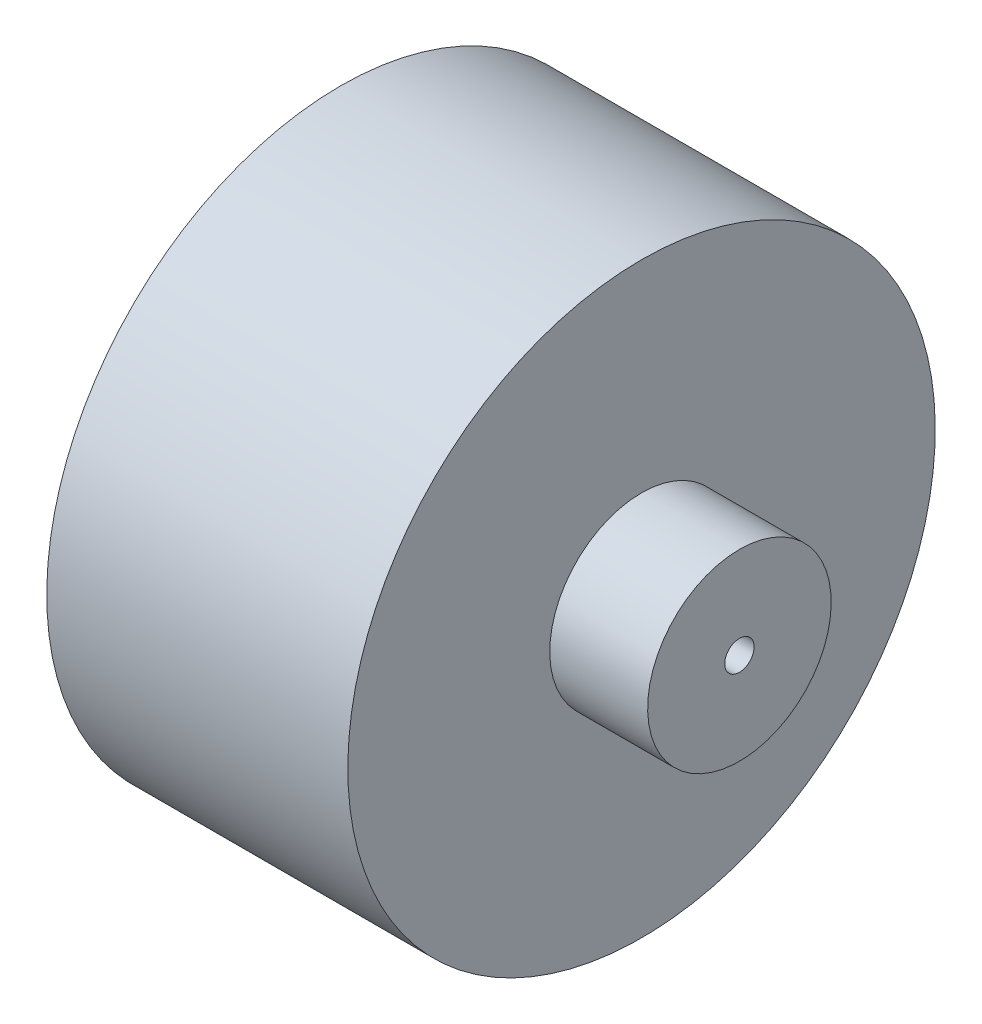
ISO-10303-21;
HEADER;
FILE_DESCRIPTION(('STEP AP214'),'2;1');
FILE_NAME('part.step','',(''),(''),'','','');
FILE_SCHEMA(('AUTOMOTIVE_DESIGN { 1 0 10303 214 1 1 1 1 }'));
ENDSEC;
DATA;
#1=APPLICATION_CONTEXT('core data for automotive mechanical design processes');
#2=APPLICATION_PROTOCOL_DEFINITION('international standard','automotive_design',2000,#1);
#3=PRODUCT_CONTEXT('',#1,'mechanical');
#4=PRODUCT('Part','Part','',(#3));
#5=PRODUCT_RELATED_PRODUCT_CATEGORY('part','',(#4));
#6=PRODUCT_DEFINITION_FORMATION('','',#4);
#7=PRODUCT_DEFINITION_CONTEXT('part definition',#1,'design');
#8=PRODUCT_DEFINITION('design','',#6,#7);
#9=PRODUCT_DEFINITION_SHAPE('','',#8);
#10=(LENGTH_UNIT() NAMED_UNIT(*) SI_UNIT(.MILLI.,.METRE.));
#11=(NAMED_UNIT(*) PLANE_ANGLE_UNIT() SI_UNIT($,.RADIAN.));
#12=(NAMED_UNIT(*) SI_UNIT($,.STERADIAN.) SOLID_ANGLE_UNIT());
#13=UNCERTAINTY_MEASURE_WITH_UNIT(LENGTH_MEASURE(1.E-05),#10,'distance_accuracy_value','');
#14=(GEOMETRIC_REPRESENTATION_CONTEXT(3) GLOBAL_UNCERTAINTY_ASSIGNED_CONTEXT((#13)) GLOBAL_UNIT_ASSIGNED_CONTEXT((#10,
#11,#12)) REPRESENTATION_CONTEXT('',''));
#15=CARTESIAN_POINT('',(0.,0.,0.));
#16=DIRECTION('',(0.,0.,1.));
#17=DIRECTION('',(1.,0.,0.));
#18=AXIS2_PLACEMENT_3D('',#15,#16,#17);
#19=CARTESIAN_POINT('',(-25.,0.,0.));
#20=DIRECTION('',(1.,0.,0.));
#21=DIRECTION('',(0.,1.,0.));
#22=AXIS2_PLACEMENT_3D('',#19,#20,#21);
#23=PLANE('',#22);
#24=CARTESIAN_POINT('',(-25.,0.,0.));
#25=DIRECTION('',(1.,0.,0.));
#26=DIRECTION('',(0.,1.,0.));
#27=AXIS2_PLACEMENT_3D('',#24,#25,#26);
#28=CIRCLE('',#27,6.);
#29=CARTESIAN_POINT('',(-25.,6.,0.));
#30=VERTEX_POINT('',#29);
#31=EDGE_CURVE('E61',#30,#30,#28,.T.);
#32=ORIENTED_EDGE('',*,*,#31,.T.);
#33=EDGE_LOOP('',(#32));
#34=FACE_BOUND('',#33,.T.);
#35=ADVANCED_FACE('F39',(#34),#23,.T.);
#36=CARTESIAN_POINT('',(-163.,0.,0.));
#37=DIRECTION('',(-1.,0.,0.));
#38=DIRECTION('',(0.,-1.,0.));
#39=AXIS2_PLACEMENT_3D('',#36,#37,#38);
#40=PLANE('',#39);
#41=CARTESIAN_POINT('',(-163.,0.,0.));
#42=DIRECTION('',(1.,0.,0.));
#43=DIRECTION('',(0.,1.,0.));
#44=AXIS2_PLACEMENT_3D('',#41,#42,#43);
#45=CIRCLE('',#44,120.);
#46=CARTESIAN_POINT('',(-163.,120.,0.));
#47=VERTEX_POINT('',#46);
#48=EDGE_CURVE('E10',#47,#47,#45,.T.);
#49=ORIENTED_EDGE('',*,*,#48,.F.);
#50=EDGE_LOOP('',(#49));
#51=FACE_BOUND('',#50,.T.);
#52=ADVANCED_FACE('F78',(#51),#40,.T.);
#53=CARTESIAN_POINT('',(0.,0.,0.));
#54=DIRECTION('',(1.,0.,0.));
#55=DIRECTION('',(0.,1.,0.));
#56=AXIS2_PLACEMENT_3D('',#53,#54,#55);
#57=CYLINDRICAL_SURFACE('',#56,120.);
#58=ORIENTED_EDGE('',*,*,#48,.T.);
#59=EDGE_LOOP('',(#58));
#60=FACE_BOUND('',#59,.T.);
#61=CARTESIAN_POINT('',(-40.,0.,0.));
#62=DIRECTION('',(1.,0.,0.));
#63=DIRECTION('',(0.,1.,0.));
#64=AXIS2_PLACEMENT_3D('',#61,#62,#63);
#65=CIRCLE('',#64,120.);
#66=CARTESIAN_POINT('',(-40.,120.,0.));
#67=VERTEX_POINT('',#66);
#68=EDGE_CURVE('E45',#67,#67,#65,.T.);
#69=ORIENTED_EDGE('',*,*,#68,.F.);
#70=EDGE_LOOP('',(#69));
#71=FACE_BOUND('',#70,.T.);
#72=ADVANCED_FACE('F82',(#60,#71),#57,.T.);
#73=CARTESIAN_POINT('',(-40.,120.,0.));
#74=DIRECTION('',(1.,0.,0.));
#75=DIRECTION('',(0.,1.,0.));
#76=AXIS2_PLACEMENT_3D('',#73,#74,#75);
#77=PLANE('',#76);
#78=ORIENTED_EDGE('',*,*,#68,.T.);
#79=EDGE_LOOP('',(#78));
#80=FACE_BOUND('',#79,.T.);
#81=CARTESIAN_POINT('',(-40.,0.,0.));
#82=DIRECTION('',(1.,0.,0.));
#83=DIRECTION('',(0.,1.,0.));
#84=AXIS2_PLACEMENT_3D('',#81,#82,#83);
#85=CIRCLE('',#84,37.5);
#86=CARTESIAN_POINT('',(-40.,37.5,0.));
#87=VERTEX_POINT('',#86);
#88=EDGE_CURVE('E49',#87,#87,#85,.T.);
#89=ORIENTED_EDGE('',*,*,#88,.F.);
#90=EDGE_LOOP('',(#89));
#91=FACE_BOUND('',#90,.T.);
#92=ADVANCED_FACE('F87',(#80,#91),#77,.T.);
#93=CARTESIAN_POINT('',(0.,0.,0.));
#94=DIRECTION('',(1.,0.,0.));
#95=DIRECTION('',(0.,1.,0.));
#96=AXIS2_PLACEMENT_3D('',#93,#94,#95);
#97=CYLINDRICAL_SURFACE('',#96,37.5);
#98=ORIENTED_EDGE('',*,*,#88,.T.);
#99=EDGE_LOOP('',(#98));
#100=FACE_BOUND('',#99,.T.);
#101=CARTESIAN_POINT('',(0.,0.,0.));
#102=DIRECTION('',(1.,0.,0.));
#103=DIRECTION('',(0.,1.,0.));
#104=AXIS2_PLACEMENT_3D('',#101,#102,#103);
#105=CIRCLE('',#104,37.5);
#106=CARTESIAN_POINT('',(0.,37.5,0.));
#107=VERTEX_POINT('',#106);
#108=EDGE_CURVE('E53',#107,#107,#105,.T.);
#109=ORIENTED_EDGE('',*,*,#108,.F.);
#110=EDGE_LOOP('',(#109));
#111=FACE_BOUND('',#110,.T.);
#112=ADVANCED_FACE('F74',(#100,#111),#97,.T.);
#113=CARTESIAN_POINT('',(0.,6.,0.));
#114=DIRECTION('',(1.,0.,0.));
#115=DIRECTION('',(0.,1.,0.));
#116=AXIS2_PLACEMENT_3D('',#113,#114,#115);
#117=PLANE('',#116);
#118=ORIENTED_EDGE('',*,*,#108,.T.);
#119=EDGE_LOOP('',(#118));
#120=FACE_BOUND('',#119,.T.);
#121=CARTESIAN_POINT('',(0.,0.,0.));
#122=DIRECTION('',(1.,0.,0.));
#123=DIRECTION('',(0.,1.,0.));
#124=AXIS2_PLACEMENT_3D('',#121,#122,#123);
#125=CIRCLE('',#124,6.);
#126=CARTESIAN_POINT('',(0.,6.,0.));
#127=VERTEX_POINT('',#126);
#128=EDGE_CURVE('E58',#127,#127,#125,.T.);
#129=ORIENTED_EDGE('',*,*,#128,.F.);
#130=EDGE_LOOP('',(#129));
#131=FACE_BOUND('',#130,.T.);
#132=ADVANCED_FACE('F68',(#120,#131),#117,.T.);
#133=CARTESIAN_POINT('',(0.,0.,0.));
#134=DIRECTION('',(1.,0.,0.));
#135=DIRECTION('',(0.,1.,0.));
#136=AXIS2_PLACEMENT_3D('',#133,#134,#135);
#137=CYLINDRICAL_SURFACE('',#136,6.);
#138=ORIENTED_EDGE('',*,*,#128,.T.);
#139=EDGE_LOOP('',(#138));
#140=FACE_BOUND('',#139,.T.);
#141=ORIENTED_EDGE('',*,*,#31,.F.);
#142=EDGE_LOOP('',(#141));
#143=FACE_BOUND('',#142,.T.);
#144=ADVANCED_FACE('F66',(#140,#143),#137,.F.);
#145=CLOSED_SHELL('',(#35,#52,#72,#92,#112,#132,#144));
#146=MANIFOLD_SOLID_BREP('B2',#145);
#147=ADVANCED_BREP_SHAPE_REPRESENTATION('',(#18,#146),#14);
#148=SHAPE_DEFINITION_REPRESENTATION(#9,#147);
ENDSEC;
END-ISO-10303-21;
